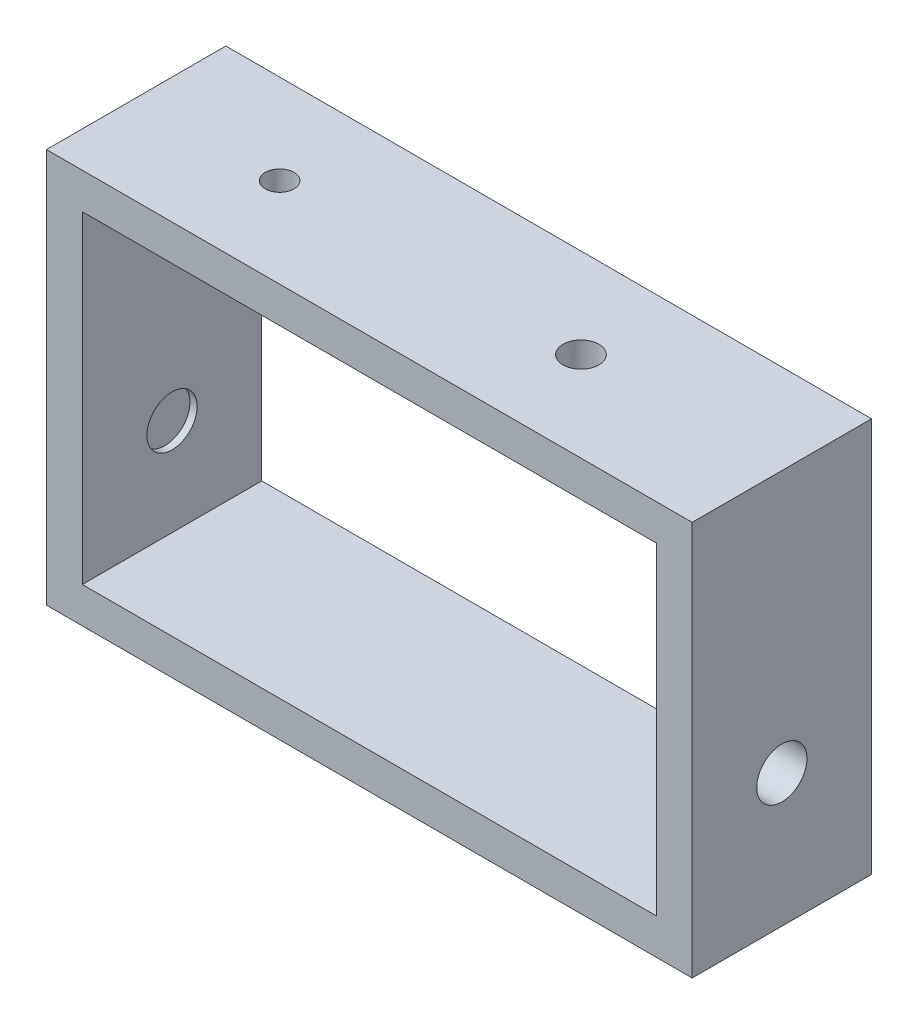
ISO-10303-21;
HEADER;
FILE_DESCRIPTION(('STEP AP214'),'2;1');
FILE_NAME('part.step','',(''),(''),'','','');
FILE_SCHEMA(('AUTOMOTIVE_DESIGN { 1 0 10303 214 1 1 1 1 }'));
ENDSEC;
DATA;
#1=APPLICATION_CONTEXT('core data for automotive mechanical design processes');
#2=APPLICATION_PROTOCOL_DEFINITION('international standard','automotive_design',2000,#1);
#3=PRODUCT_CONTEXT('',#1,'mechanical');
#4=PRODUCT('Part','Part','',(#3));
#5=PRODUCT_RELATED_PRODUCT_CATEGORY('part','',(#4));
#6=PRODUCT_DEFINITION_FORMATION('','',#4);
#7=PRODUCT_DEFINITION_CONTEXT('part definition',#1,'design');
#8=PRODUCT_DEFINITION('design','',#6,#7);
#9=PRODUCT_DEFINITION_SHAPE('','',#8);
#10=(LENGTH_UNIT() NAMED_UNIT(*) SI_UNIT(.MILLI.,.METRE.));
#11=(NAMED_UNIT(*) PLANE_ANGLE_UNIT() SI_UNIT($,.RADIAN.));
#12=(NAMED_UNIT(*) SI_UNIT($,.STERADIAN.) SOLID_ANGLE_UNIT());
#13=UNCERTAINTY_MEASURE_WITH_UNIT(LENGTH_MEASURE(1.E-05),#10,'distance_accuracy_value','');
#14=(GEOMETRIC_REPRESENTATION_CONTEXT(3) GLOBAL_UNCERTAINTY_ASSIGNED_CONTEXT((#13)) GLOBAL_UNIT_ASSIGNED_CONTEXT((#10,
#11,#12)) REPRESENTATION_CONTEXT('',''));
#15=CARTESIAN_POINT('',(0.,0.,0.));
#16=DIRECTION('',(0.,0.,1.));
#17=DIRECTION('',(1.,0.,0.));
#18=AXIS2_PLACEMENT_3D('',#15,#16,#17);
#19=CARTESIAN_POINT('',(0.,0.,12.5));
#20=DIRECTION('',(0.,0.,-1.));
#21=DIRECTION('',(-1.,0.,0.));
#22=AXIS2_PLACEMENT_3D('',#19,#20,#21);
#23=PLANE('',#22);
#24=DIRECTION('',(0.,-1.,0.));
#25=VECTOR('',#24,1.);
#26=CARTESIAN_POINT('',(0.,0.,12.5));
#27=LINE('',#26,#25);
#28=CARTESIAN_POINT('',(0.,55.,12.5));
#29=VERTEX_POINT('',#28);
#30=CARTESIAN_POINT('',(0.,0.,12.5));
#31=VERTEX_POINT('',#30);
#32=EDGE_CURVE('E138',#29,#31,#27,.T.);
#33=ORIENTED_EDGE('',*,*,#32,.T.);
#34=DIRECTION('',(1.,0.,0.));
#35=VECTOR('',#34,1.);
#36=CARTESIAN_POINT('',(0.,0.,12.5));
#37=LINE('',#36,#35);
#38=CARTESIAN_POINT('',(90.,0.,12.5));
#39=VERTEX_POINT('',#38);
#40=EDGE_CURVE('E141',#31,#39,#37,.T.);
#41=ORIENTED_EDGE('',*,*,#40,.T.);
#42=DIRECTION('',(0.,1.,0.));
#43=VECTOR('',#42,1.);
#44=CARTESIAN_POINT('',(90.,0.,12.5));
#45=LINE('',#44,#43);
#46=CARTESIAN_POINT('',(90.,55.,12.5));
#47=VERTEX_POINT('',#46);
#48=EDGE_CURVE('E144',#39,#47,#45,.T.);
#49=ORIENTED_EDGE('',*,*,#48,.T.);
#50=DIRECTION('',(-1.,0.,0.));
#51=VECTOR('',#50,1.);
#52=CARTESIAN_POINT('',(0.,55.,12.5));
#53=LINE('',#52,#51);
#54=EDGE_CURVE('E146',#47,#29,#53,.T.);
#55=ORIENTED_EDGE('',*,*,#54,.T.);
#56=EDGE_LOOP('',(#33,#41,#49,#55));
#57=FACE_BOUND('',#56,.T.);
#58=DIRECTION('',(0.,-1.,0.));
#59=VECTOR('',#58,1.);
#60=CARTESIAN_POINT('',(5.,5.,12.5));
#61=LINE('',#60,#59);
#62=CARTESIAN_POINT('',(5.,50.,12.5));
#63=VERTEX_POINT('',#62);
#64=CARTESIAN_POINT('',(5.,5.,12.5));
#65=VERTEX_POINT('',#64);
#66=EDGE_CURVE('E100',#63,#65,#61,.T.);
#67=ORIENTED_EDGE('',*,*,#66,.F.);
#68=DIRECTION('',(-1.,0.,0.));
#69=VECTOR('',#68,1.);
#70=CARTESIAN_POINT('',(5.,50.,12.5));
#71=LINE('',#70,#69);
#72=CARTESIAN_POINT('',(85.,50.,12.5));
#73=VERTEX_POINT('',#72);
#74=EDGE_CURVE('E122',#73,#63,#71,.T.);
#75=ORIENTED_EDGE('',*,*,#74,.F.);
#76=DIRECTION('',(0.,1.,0.));
#77=VECTOR('',#76,1.);
#78=CARTESIAN_POINT('',(85.,5.,12.5));
#79=LINE('',#78,#77);
#80=CARTESIAN_POINT('',(85.,5.,12.5));
#81=VERTEX_POINT('',#80);
#82=EDGE_CURVE('E120',#81,#73,#79,.T.);
#83=ORIENTED_EDGE('',*,*,#82,.F.);
#84=DIRECTION('',(1.,0.,0.));
#85=VECTOR('',#84,1.);
#86=CARTESIAN_POINT('',(5.,5.,12.5));
#87=LINE('',#86,#85);
#88=EDGE_CURVE('E108',#65,#81,#87,.T.);
#89=ORIENTED_EDGE('',*,*,#88,.F.);
#90=EDGE_LOOP('',(#67,#75,#83,#89));
#91=FACE_BOUND('',#90,.T.);
#92=ADVANCED_FACE('F33',(#57,#91),#23,.F.);
#93=CARTESIAN_POINT('',(0.,0.,-12.5));
#94=DIRECTION('',(0.,0.,-1.));
#95=DIRECTION('',(-1.,0.,0.));
#96=AXIS2_PLACEMENT_3D('',#93,#94,#95);
#97=PLANE('',#96);
#98=DIRECTION('',(0.,-1.,0.));
#99=VECTOR('',#98,1.);
#100=CARTESIAN_POINT('',(0.,0.,-12.5));
#101=LINE('',#100,#99);
#102=CARTESIAN_POINT('',(0.,55.,-12.5));
#103=VERTEX_POINT('',#102);
#104=CARTESIAN_POINT('',(0.,0.,-12.5));
#105=VERTEX_POINT('',#104);
#106=EDGE_CURVE('E116',#103,#105,#101,.T.);
#107=ORIENTED_EDGE('',*,*,#106,.F.);
#108=DIRECTION('',(-1.,0.,0.));
#109=VECTOR('',#108,1.);
#110=CARTESIAN_POINT('',(0.,55.,-12.5));
#111=LINE('',#110,#109);
#112=CARTESIAN_POINT('',(90.,55.,-12.5));
#113=VERTEX_POINT('',#112);
#114=EDGE_CURVE('E142',#113,#103,#111,.T.);
#115=ORIENTED_EDGE('',*,*,#114,.F.);
#116=DIRECTION('',(0.,1.,0.));
#117=VECTOR('',#116,1.);
#118=CARTESIAN_POINT('',(90.,0.,-12.5));
#119=LINE('',#118,#117);
#120=CARTESIAN_POINT('',(90.,0.,-12.5));
#121=VERTEX_POINT('',#120);
#122=EDGE_CURVE('E153',#121,#113,#119,.T.);
#123=ORIENTED_EDGE('',*,*,#122,.F.);
#124=DIRECTION('',(1.,0.,0.));
#125=VECTOR('',#124,1.);
#126=CARTESIAN_POINT('',(0.,0.,-12.5));
#127=LINE('',#126,#125);
#128=EDGE_CURVE('E151',#105,#121,#127,.T.);
#129=ORIENTED_EDGE('',*,*,#128,.F.);
#130=EDGE_LOOP('',(#107,#115,#123,#129));
#131=FACE_BOUND('',#130,.T.);
#132=DIRECTION('',(-1.,0.,0.));
#133=VECTOR('',#132,1.);
#134=CARTESIAN_POINT('',(5.,50.,-12.5));
#135=LINE('',#134,#133);
#136=CARTESIAN_POINT('',(85.,50.,-12.5));
#137=VERTEX_POINT('',#136);
#138=CARTESIAN_POINT('',(5.,50.,-12.5));
#139=VERTEX_POINT('',#138);
#140=EDGE_CURVE('E109',#137,#139,#135,.T.);
#141=ORIENTED_EDGE('',*,*,#140,.T.);
#142=DIRECTION('',(0.,-1.,0.));
#143=VECTOR('',#142,1.);
#144=CARTESIAN_POINT('',(5.,5.,-12.5));
#145=LINE('',#144,#143);
#146=CARTESIAN_POINT('',(5.,5.,-12.5));
#147=VERTEX_POINT('',#146);
#148=EDGE_CURVE('E58',#139,#147,#145,.T.);
#149=ORIENTED_EDGE('',*,*,#148,.T.);
#150=DIRECTION('',(1.,0.,0.));
#151=VECTOR('',#150,1.);
#152=CARTESIAN_POINT('',(5.,5.,-12.5));
#153=LINE('',#152,#151);
#154=CARTESIAN_POINT('',(85.,5.,-12.5));
#155=VERTEX_POINT('',#154);
#156=EDGE_CURVE('E115',#147,#155,#153,.T.);
#157=ORIENTED_EDGE('',*,*,#156,.T.);
#158=DIRECTION('',(0.,1.,0.));
#159=VECTOR('',#158,1.);
#160=CARTESIAN_POINT('',(85.,5.,-12.5));
#161=LINE('',#160,#159);
#162=EDGE_CURVE('E130',#155,#137,#161,.T.);
#163=ORIENTED_EDGE('',*,*,#162,.T.);
#164=EDGE_LOOP('',(#141,#149,#157,#163));
#165=FACE_BOUND('',#164,.T.);
#166=ADVANCED_FACE('F203',(#131,#165),#97,.T.);
#167=CARTESIAN_POINT('',(0.,0.,12.5));
#168=DIRECTION('',(1.,0.,0.));
#169=DIRECTION('',(0.,0.,-1.));
#170=AXIS2_PLACEMENT_3D('',#167,#168,#169);
#171=PLANE('',#170);
#172=ORIENTED_EDGE('',*,*,#106,.T.);
#173=DIRECTION('',(0.,0.,-1.));
#174=VECTOR('',#173,1.);
#175=CARTESIAN_POINT('',(0.,0.,12.5));
#176=LINE('',#175,#174);
#177=EDGE_CURVE('E11',#31,#105,#176,.T.);
#178=ORIENTED_EDGE('',*,*,#177,.F.);
#179=ORIENTED_EDGE('',*,*,#32,.F.);
#180=DIRECTION('',(0.,0.,-1.));
#181=VECTOR('',#180,1.);
#182=CARTESIAN_POINT('',(0.,55.,12.5));
#183=LINE('',#182,#181);
#184=EDGE_CURVE('E148',#29,#103,#183,.T.);
#185=ORIENTED_EDGE('',*,*,#184,.T.);
#186=EDGE_LOOP('',(#172,#178,#179,#185));
#187=FACE_BOUND('',#186,.T.);
#188=ADVANCED_FACE('F35',(#187),#171,.F.);
#189=CARTESIAN_POINT('',(0.,0.,12.5));
#190=DIRECTION('',(0.,1.,0.));
#191=DIRECTION('',(0.,0.,1.));
#192=AXIS2_PLACEMENT_3D('',#189,#190,#191);
#193=PLANE('',#192);
#194=ORIENTED_EDGE('',*,*,#128,.T.);
#195=DIRECTION('',(0.,0.,-1.));
#196=VECTOR('',#195,1.);
#197=CARTESIAN_POINT('',(90.,0.,12.5));
#198=LINE('',#197,#196);
#199=EDGE_CURVE('E42',#39,#121,#198,.T.);
#200=ORIENTED_EDGE('',*,*,#199,.F.);
#201=ORIENTED_EDGE('',*,*,#40,.F.);
#202=ORIENTED_EDGE('',*,*,#177,.T.);
#203=EDGE_LOOP('',(#194,#200,#201,#202));
#204=FACE_BOUND('',#203,.T.);
#205=ADVANCED_FACE('F212',(#204),#193,.F.);
#206=CARTESIAN_POINT('',(90.,0.,12.5));
#207=DIRECTION('',(-1.,0.,0.));
#208=DIRECTION('',(0.,0.,1.));
#209=AXIS2_PLACEMENT_3D('',#206,#207,#208);
#210=PLANE('',#209);
#211=CARTESIAN_POINT('',(90.,18.5,0.));
#212=DIRECTION('',(1.,0.,0.));
#213=DIRECTION('',(0.,0.,-1.));
#214=AXIS2_PLACEMENT_3D('',#211,#212,#213);
#215=CIRCLE('',#214,3.5);
#216=CARTESIAN_POINT('',(90.,18.5,-3.5));
#217=VERTEX_POINT('',#216);
#218=EDGE_CURVE('E168',#217,#217,#215,.T.);
#219=ORIENTED_EDGE('',*,*,#218,.F.);
#220=EDGE_LOOP('',(#219));
#221=FACE_BOUND('',#220,.T.);
#222=ORIENTED_EDGE('',*,*,#122,.T.);
#223=DIRECTION('',(0.,0.,-1.));
#224=VECTOR('',#223,1.);
#225=CARTESIAN_POINT('',(90.,55.,12.5));
#226=LINE('',#225,#224);
#227=EDGE_CURVE('E158',#47,#113,#226,.T.);
#228=ORIENTED_EDGE('',*,*,#227,.F.);
#229=ORIENTED_EDGE('',*,*,#48,.F.);
#230=ORIENTED_EDGE('',*,*,#199,.T.);
#231=EDGE_LOOP('',(#222,#228,#229,#230));
#232=FACE_BOUND('',#231,.T.);
#233=ADVANCED_FACE('F198',(#221,#232),#210,.F.);
#234=CARTESIAN_POINT('',(0.,55.,12.5));
#235=DIRECTION('',(0.,-1.,0.));
#236=DIRECTION('',(0.,0.,-1.));
#237=AXIS2_PLACEMENT_3D('',#234,#235,#236);
#238=PLANE('',#237);
#239=CARTESIAN_POINT('',(62.,55.,0.));
#240=DIRECTION('',(0.,1.,0.));
#241=DIRECTION('',(0.,0.,1.));
#242=AXIS2_PLACEMENT_3D('',#239,#240,#241);
#243=CIRCLE('',#242,2.5);
#244=CARTESIAN_POINT('',(62.,55.,2.5));
#245=VERTEX_POINT('',#244);
#246=EDGE_CURVE('E179',#245,#245,#243,.T.);
#247=ORIENTED_EDGE('',*,*,#246,.F.);
#248=EDGE_LOOP('',(#247));
#249=FACE_BOUND('',#248,.T.);
#250=CARTESIAN_POINT('',(20.,55.,0.));
#251=DIRECTION('',(0.,1.,0.));
#252=DIRECTION('',(0.,0.,1.));
#253=AXIS2_PLACEMENT_3D('',#250,#251,#252);
#254=CIRCLE('',#253,2.);
#255=CARTESIAN_POINT('',(20.,55.,2.));
#256=VERTEX_POINT('',#255);
#257=EDGE_CURVE('E169',#256,#256,#254,.T.);
#258=ORIENTED_EDGE('',*,*,#257,.F.);
#259=EDGE_LOOP('',(#258));
#260=FACE_BOUND('',#259,.T.);
#261=ORIENTED_EDGE('',*,*,#114,.T.);
#262=ORIENTED_EDGE('',*,*,#184,.F.);
#263=ORIENTED_EDGE('',*,*,#54,.F.);
#264=ORIENTED_EDGE('',*,*,#227,.T.);
#265=EDGE_LOOP('',(#261,#262,#263,#264));
#266=FACE_BOUND('',#265,.T.);
#267=ADVANCED_FACE('F190',(#249,#260,#266),#238,.F.);
#268=CARTESIAN_POINT('',(5.,5.,12.5));
#269=DIRECTION('',(1.,0.,0.));
#270=DIRECTION('',(0.,0.,-1.));
#271=AXIS2_PLACEMENT_3D('',#268,#269,#270);
#272=PLANE('',#271);
#273=CARTESIAN_POINT('',(5.,18.5,0.));
#274=DIRECTION('',(1.,0.,0.));
#275=DIRECTION('',(0.,0.,-1.));
#276=AXIS2_PLACEMENT_3D('',#273,#274,#275);
#277=CIRCLE('',#276,3.5);
#278=CARTESIAN_POINT('',(5.,18.5,-3.5));
#279=VERTEX_POINT('',#278);
#280=EDGE_CURVE('E128',#279,#279,#277,.T.);
#281=ORIENTED_EDGE('',*,*,#280,.F.);
#282=EDGE_LOOP('',(#281));
#283=FACE_BOUND('',#282,.T.);
#284=ORIENTED_EDGE('',*,*,#148,.F.);
#285=DIRECTION('',(0.,0.,-1.));
#286=VECTOR('',#285,1.);
#287=CARTESIAN_POINT('',(5.,50.,12.5));
#288=LINE('',#287,#286);
#289=EDGE_CURVE('E104',#63,#139,#288,.T.);
#290=ORIENTED_EDGE('',*,*,#289,.F.);
#291=ORIENTED_EDGE('',*,*,#66,.T.);
#292=DIRECTION('',(0.,0.,-1.));
#293=VECTOR('',#292,1.);
#294=CARTESIAN_POINT('',(5.,5.,12.5));
#295=LINE('',#294,#293);
#296=EDGE_CURVE('E103',#65,#147,#295,.T.);
#297=ORIENTED_EDGE('',*,*,#296,.T.);
#298=EDGE_LOOP('',(#284,#290,#291,#297));
#299=FACE_BOUND('',#298,.T.);
#300=ADVANCED_FACE('F102',(#283,#299),#272,.T.);
#301=CARTESIAN_POINT('',(5.,5.,12.5));
#302=DIRECTION('',(0.,1.,0.));
#303=DIRECTION('',(0.,0.,1.));
#304=AXIS2_PLACEMENT_3D('',#301,#302,#303);
#305=PLANE('',#304);
#306=ORIENTED_EDGE('',*,*,#156,.F.);
#307=ORIENTED_EDGE('',*,*,#296,.F.);
#308=ORIENTED_EDGE('',*,*,#88,.T.);
#309=DIRECTION('',(0.,0.,-1.));
#310=VECTOR('',#309,1.);
#311=CARTESIAN_POINT('',(85.,5.,12.5));
#312=LINE('',#311,#310);
#313=EDGE_CURVE('E117',#81,#155,#312,.T.);
#314=ORIENTED_EDGE('',*,*,#313,.T.);
#315=EDGE_LOOP('',(#306,#307,#308,#314));
#316=FACE_BOUND('',#315,.T.);
#317=ADVANCED_FACE('F112',(#316),#305,.T.);
#318=CARTESIAN_POINT('',(85.,5.,12.5));
#319=DIRECTION('',(-1.,0.,0.));
#320=DIRECTION('',(0.,0.,1.));
#321=AXIS2_PLACEMENT_3D('',#318,#319,#320);
#322=PLANE('',#321);
#323=CARTESIAN_POINT('',(85.,18.5,0.));
#324=DIRECTION('',(-1.,0.,0.));
#325=DIRECTION('',(0.,0.,1.));
#326=AXIS2_PLACEMENT_3D('',#323,#324,#325);
#327=CIRCLE('',#326,3.5);
#328=CARTESIAN_POINT('',(85.,18.5,3.5));
#329=VERTEX_POINT('',#328);
#330=EDGE_CURVE('E163',#329,#329,#327,.T.);
#331=ORIENTED_EDGE('',*,*,#330,.F.);
#332=EDGE_LOOP('',(#331));
#333=FACE_BOUND('',#332,.T.);
#334=ORIENTED_EDGE('',*,*,#162,.F.);
#335=ORIENTED_EDGE('',*,*,#313,.F.);
#336=ORIENTED_EDGE('',*,*,#82,.T.);
#337=DIRECTION('',(0.,0.,-1.));
#338=VECTOR('',#337,1.);
#339=CARTESIAN_POINT('',(85.,50.,12.5));
#340=LINE('',#339,#338);
#341=EDGE_CURVE('E50',#73,#137,#340,.T.);
#342=ORIENTED_EDGE('',*,*,#341,.T.);
#343=EDGE_LOOP('',(#334,#335,#336,#342));
#344=FACE_BOUND('',#343,.T.);
#345=ADVANCED_FACE('F196',(#333,#344),#322,.T.);
#346=CARTESIAN_POINT('',(5.,50.,12.5));
#347=DIRECTION('',(0.,-1.,0.));
#348=DIRECTION('',(0.,0.,-1.));
#349=AXIS2_PLACEMENT_3D('',#346,#347,#348);
#350=PLANE('',#349);
#351=CARTESIAN_POINT('',(62.,50.,0.));
#352=DIRECTION('',(0.,-1.,0.));
#353=DIRECTION('',(0.,0.,-1.));
#354=AXIS2_PLACEMENT_3D('',#351,#352,#353);
#355=CIRCLE('',#354,2.5);
#356=CARTESIAN_POINT('',(62.,50.,-2.5));
#357=VERTEX_POINT('',#356);
#358=EDGE_CURVE('E37',#357,#357,#355,.T.);
#359=ORIENTED_EDGE('',*,*,#358,.F.);
#360=EDGE_LOOP('',(#359));
#361=FACE_BOUND('',#360,.T.);
#362=CARTESIAN_POINT('',(20.,50.,0.));
#363=DIRECTION('',(0.,-1.,0.));
#364=DIRECTION('',(0.,0.,-1.));
#365=AXIS2_PLACEMENT_3D('',#362,#363,#364);
#366=CIRCLE('',#365,2.);
#367=CARTESIAN_POINT('',(20.,50.,-2.));
#368=VERTEX_POINT('',#367);
#369=EDGE_CURVE('E166',#368,#368,#366,.T.);
#370=ORIENTED_EDGE('',*,*,#369,.F.);
#371=EDGE_LOOP('',(#370));
#372=FACE_BOUND('',#371,.T.);
#373=ORIENTED_EDGE('',*,*,#140,.F.);
#374=ORIENTED_EDGE('',*,*,#341,.F.);
#375=ORIENTED_EDGE('',*,*,#74,.T.);
#376=ORIENTED_EDGE('',*,*,#289,.T.);
#377=EDGE_LOOP('',(#373,#374,#375,#376));
#378=FACE_BOUND('',#377,.T.);
#379=ADVANCED_FACE('F234',(#361,#372,#378),#350,.T.);
#380=CARTESIAN_POINT('',(4.,18.5,0.));
#381=DIRECTION('',(1.,0.,0.));
#382=DIRECTION('',(0.,0.,-1.));
#383=AXIS2_PLACEMENT_3D('',#380,#381,#382);
#384=CYLINDRICAL_SURFACE('',#383,3.5);
#385=ORIENTED_EDGE('',*,*,#330,.T.);
#386=EDGE_LOOP('',(#385));
#387=FACE_BOUND('',#386,.T.);
#388=ORIENTED_EDGE('',*,*,#218,.T.);
#389=EDGE_LOOP('',(#388));
#390=FACE_BOUND('',#389,.T.);
#391=ADVANCED_FACE('F236',(#387,#390),#384,.F.);
#392=ORIENTED_EDGE('',*,*,#280,.T.);
#393=EDGE_LOOP('',(#392));
#394=FACE_BOUND('',#393,.T.);
#395=CARTESIAN_POINT('',(4.,18.5,0.));
#396=DIRECTION('',(1.,0.,0.));
#397=DIRECTION('',(0.,0.,-1.));
#398=AXIS2_PLACEMENT_3D('',#395,#396,#397);
#399=CIRCLE('',#398,3.5);
#400=CARTESIAN_POINT('',(4.,18.5,-3.5));
#401=VERTEX_POINT('',#400);
#402=EDGE_CURVE('E165',#401,#401,#399,.T.);
#403=ORIENTED_EDGE('',*,*,#402,.F.);
#404=EDGE_LOOP('',(#403));
#405=FACE_BOUND('',#404,.T.);
#406=ADVANCED_FACE('F186',(#394,#405),#384,.F.);
#407=CARTESIAN_POINT('',(4.,18.5,0.));
#408=DIRECTION('',(1.,0.,0.));
#409=DIRECTION('',(0.,0.,-1.));
#410=AXIS2_PLACEMENT_3D('',#407,#408,#409);
#411=PLANE('',#410);
#412=ORIENTED_EDGE('',*,*,#402,.T.);
#413=EDGE_LOOP('',(#412));
#414=FACE_BOUND('',#413,.T.);
#415=ADVANCED_FACE('F250',(#414),#411,.T.);
#416=CARTESIAN_POINT('',(20.,45.,0.));
#417=DIRECTION('',(0.,1.,0.));
#418=DIRECTION('',(0.,0.,1.));
#419=AXIS2_PLACEMENT_3D('',#416,#417,#418);
#420=CYLINDRICAL_SURFACE('',#419,2.);
#421=ORIENTED_EDGE('',*,*,#369,.T.);
#422=EDGE_LOOP('',(#421));
#423=FACE_BOUND('',#422,.T.);
#424=ORIENTED_EDGE('',*,*,#257,.T.);
#425=EDGE_LOOP('',(#424));
#426=FACE_BOUND('',#425,.T.);
#427=ADVANCED_FACE('F253',(#423,#426),#420,.F.);
#428=CARTESIAN_POINT('',(62.,45.,0.));
#429=DIRECTION('',(0.,1.,0.));
#430=DIRECTION('',(0.,0.,1.));
#431=AXIS2_PLACEMENT_3D('',#428,#429,#430);
#432=CYLINDRICAL_SURFACE('',#431,2.5);
#433=ORIENTED_EDGE('',*,*,#358,.T.);
#434=EDGE_LOOP('',(#433));
#435=FACE_BOUND('',#434,.T.);
#436=ORIENTED_EDGE('',*,*,#246,.T.);
#437=EDGE_LOOP('',(#436));
#438=FACE_BOUND('',#437,.T.);
#439=ADVANCED_FACE('F257',(#435,#438),#432,.F.);
#440=CLOSED_SHELL('',(#92,#166,#188,#205,#233,#267,#300,#317,#345,#379,#391,#406,#415,#427,#439));
#441=MANIFOLD_SOLID_BREP('B2',#440);
#442=ADVANCED_BREP_SHAPE_REPRESENTATION('',(#18,#441),#14);
#443=SHAPE_DEFINITION_REPRESENTATION(#9,#442);
ENDSEC;
END-ISO-10303-21;
